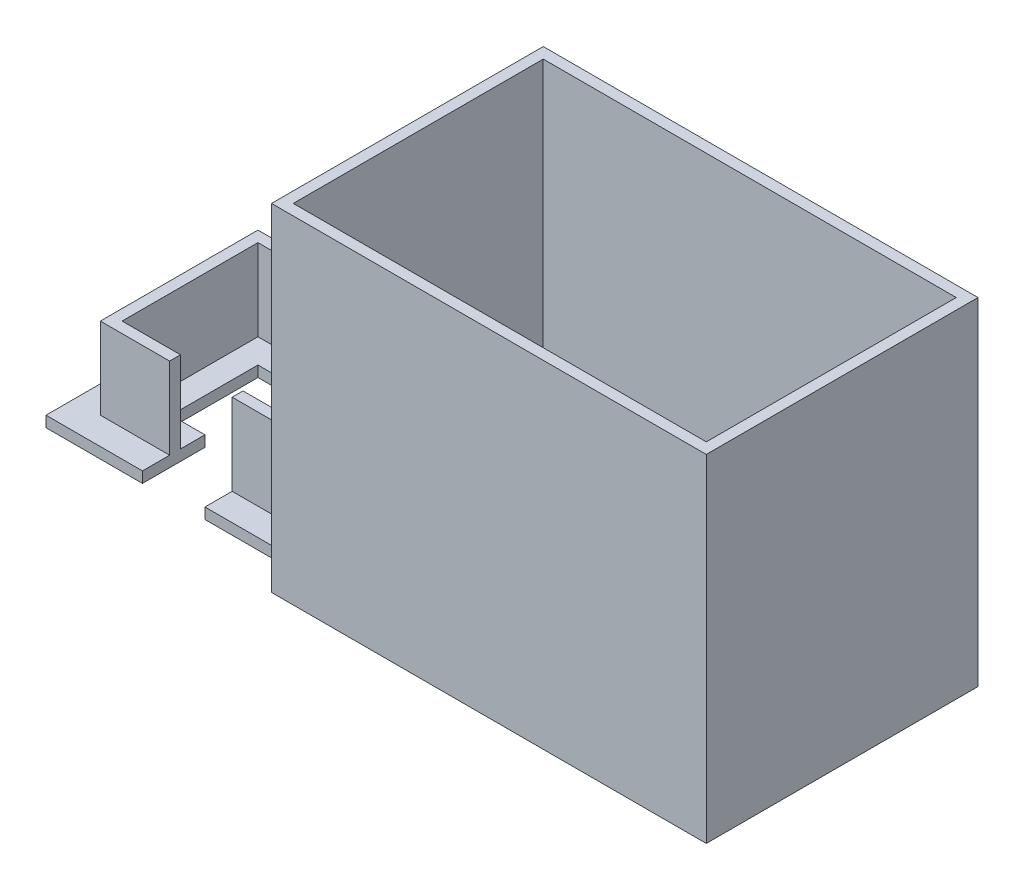
ISO-10303-21;
HEADER;
FILE_DESCRIPTION(('STEP AP214'),'2;1');
FILE_NAME('part.step','',(''),(''),'','','');
FILE_SCHEMA(('AUTOMOTIVE_DESIGN { 1 0 10303 214 1 1 1 1 }'));
ENDSEC;
DATA;
#1=APPLICATION_CONTEXT('core data for automotive mechanical design processes');
#2=APPLICATION_PROTOCOL_DEFINITION('international standard','automotive_design',2000,#1);
#3=PRODUCT_CONTEXT('',#1,'mechanical');
#4=PRODUCT('Part','Part','',(#3));
#5=PRODUCT_RELATED_PRODUCT_CATEGORY('part','',(#4));
#6=PRODUCT_DEFINITION_FORMATION('','',#4);
#7=PRODUCT_DEFINITION_CONTEXT('part definition',#1,'design');
#8=PRODUCT_DEFINITION('design','',#6,#7);
#9=PRODUCT_DEFINITION_SHAPE('','',#8);
#10=(LENGTH_UNIT() NAMED_UNIT(*) SI_UNIT(.MILLI.,.METRE.));
#11=(NAMED_UNIT(*) PLANE_ANGLE_UNIT() SI_UNIT($,.RADIAN.));
#12=(NAMED_UNIT(*) SI_UNIT($,.STERADIAN.) SOLID_ANGLE_UNIT());
#13=UNCERTAINTY_MEASURE_WITH_UNIT(LENGTH_MEASURE(1.E-05),#10,'distance_accuracy_value','');
#14=(GEOMETRIC_REPRESENTATION_CONTEXT(3) GLOBAL_UNCERTAINTY_ASSIGNED_CONTEXT((#13)) GLOBAL_UNIT_ASSIGNED_CONTEXT((#10,
#11,#12)) REPRESENTATION_CONTEXT('',''));
#15=CARTESIAN_POINT('',(0.,0.,0.));
#16=DIRECTION('',(0.,0.,1.));
#17=DIRECTION('',(1.,0.,0.));
#18=AXIS2_PLACEMENT_3D('',#15,#16,#17);
#19=CARTESIAN_POINT('',(0.,2.54,0.));
#20=DIRECTION('',(0.,1.,0.));
#21=DIRECTION('',(0.,0.,1.));
#22=AXIS2_PLACEMENT_3D('',#19,#20,#21);
#23=PLANE('',#22);
#24=DIRECTION('',(0.,0.,-1.));
#25=VECTOR('',#24,1.);
#26=CARTESIAN_POINT('',(-73.3425,2.54,0.));
#27=LINE('',#26,#25);
#28=CARTESIAN_POINT('',(-73.3425,2.54,24.765));
#29=VERTEX_POINT('',#28);
#30=CARTESIAN_POINT('',(-73.3425,2.54,18.415));
#31=VERTEX_POINT('',#30);
#32=EDGE_CURVE('E281',#29,#31,#27,.T.);
#33=ORIENTED_EDGE('',*,*,#32,.F.);
#34=DIRECTION('',(1.,0.,0.));
#35=VECTOR('',#34,1.);
#36=CARTESIAN_POINT('',(0.,2.54,24.765));
#37=LINE('',#36,#35);
#38=CARTESIAN_POINT('',(-50.8,2.54,24.765));
#39=VERTEX_POINT('',#38);
#40=EDGE_CURVE('E361',#29,#39,#37,.T.);
#41=ORIENTED_EDGE('',*,*,#40,.T.);
#42=DIRECTION('',(0.,0.,-1.));
#43=VECTOR('',#42,1.);
#44=CARTESIAN_POINT('',(-50.8,2.54,0.));
#45=LINE('',#44,#43);
#46=CARTESIAN_POINT('',(-50.8,2.54,18.415));
#47=VERTEX_POINT('',#46);
#48=EDGE_CURVE('E362',#39,#47,#45,.T.);
#49=ORIENTED_EDGE('',*,*,#48,.T.);
#50=DIRECTION('',(-1.,0.,0.));
#51=VECTOR('',#50,1.);
#52=CARTESIAN_POINT('',(0.,2.54,18.415));
#53=LINE('',#52,#51);
#54=EDGE_CURVE('E331',#47,#31,#53,.T.);
#55=ORIENTED_EDGE('',*,*,#54,.T.);
#56=EDGE_LOOP('',(#33,#41,#49,#55));
#57=FACE_BOUND('',#56,.T.);
#58=ADVANCED_FACE('F37',(#57),#23,.T.);
#59=CARTESIAN_POINT('',(0.,2.54,24.765));
#60=DIRECTION('',(0.,0.,-1.));
#61=DIRECTION('',(-1.,0.,0.));
#62=AXIS2_PLACEMENT_3D('',#59,#60,#61);
#63=PLANE('',#62);
#64=ORIENTED_EDGE('',*,*,#40,.F.);
#65=DIRECTION('',(0.,1.,0.));
#66=VECTOR('',#65,1.);
#67=CARTESIAN_POINT('',(-73.3425,0.,24.765));
#68=LINE('',#67,#66);
#69=CARTESIAN_POINT('',(-73.3425,0.,24.765));
#70=VERTEX_POINT('',#69);
#71=EDGE_CURVE('E474',#70,#29,#68,.T.);
#72=ORIENTED_EDGE('',*,*,#71,.F.);
#73=DIRECTION('',(1.,0.,0.));
#74=VECTOR('',#73,1.);
#75=CARTESIAN_POINT('',(0.,0.,24.765));
#76=LINE('',#75,#74);
#77=CARTESIAN_POINT('',(-50.8,0.,24.765));
#78=VERTEX_POINT('',#77);
#79=EDGE_CURVE('E260',#70,#78,#76,.T.);
#80=ORIENTED_EDGE('',*,*,#79,.T.);
#81=DIRECTION('',(0.,-1.,0.));
#82=VECTOR('',#81,1.);
#83=CARTESIAN_POINT('',(-50.8,2.54,24.765));
#84=LINE('',#83,#82);
#85=EDGE_CURVE('E388',#39,#78,#84,.T.);
#86=ORIENTED_EDGE('',*,*,#85,.F.);
#87=EDGE_LOOP('',(#64,#72,#80,#86));
#88=FACE_BOUND('',#87,.T.);
#89=ADVANCED_FACE('F473',(#88),#63,.F.);
#90=DIRECTION('',(0.,0.,-1.));
#91=VECTOR('',#90,1.);
#92=CARTESIAN_POINT('',(-73.3425,2.54,0.));
#93=LINE('',#92,#91);
#94=CARTESIAN_POINT('',(-73.3425,2.54,15.875));
#95=VERTEX_POINT('',#94);
#96=CARTESIAN_POINT('',(-73.3425,2.54,10.16));
#97=VERTEX_POINT('',#96);
#98=EDGE_CURVE('E60',#95,#97,#93,.T.);
#99=ORIENTED_EDGE('',*,*,#98,.F.);
#100=DIRECTION('',(-1.,0.,0.));
#101=VECTOR('',#100,1.);
#102=CARTESIAN_POINT('',(0.,2.54,15.875));
#103=LINE('',#102,#101);
#104=CARTESIAN_POINT('',(-50.8,2.54,15.875));
#105=VERTEX_POINT('',#104);
#106=EDGE_CURVE('E300',#105,#95,#103,.T.);
#107=ORIENTED_EDGE('',*,*,#106,.F.);
#108=CARTESIAN_POINT('',(-50.8,2.54,10.16));
#109=VERTEX_POINT('',#108);
#110=EDGE_CURVE('E366',#105,#109,#45,.T.);
#111=ORIENTED_EDGE('',*,*,#110,.T.);
#112=DIRECTION('',(1.,0.,0.));
#113=VECTOR('',#112,1.);
#114=CARTESIAN_POINT('',(-50.8,2.54,10.16));
#115=LINE('',#114,#113);
#116=EDGE_CURVE('E284',#97,#109,#115,.T.);
#117=ORIENTED_EDGE('',*,*,#116,.F.);
#118=EDGE_LOOP('',(#99,#107,#111,#117));
#119=FACE_BOUND('',#118,.T.);
#120=ADVANCED_FACE('F534',(#119),#23,.T.);
#121=CARTESIAN_POINT('',(0.,21.59,18.415));
#122=DIRECTION('',(0.,0.,1.));
#123=DIRECTION('',(1.,0.,0.));
#124=AXIS2_PLACEMENT_3D('',#121,#122,#123);
#125=PLANE('',#124);
#126=DIRECTION('',(0.,1.,0.));
#127=VECTOR('',#126,1.);
#128=CARTESIAN_POINT('',(-73.3425,21.59,18.415));
#129=LINE('',#128,#127);
#130=CARTESIAN_POINT('',(-73.3425,21.59,18.415));
#131=VERTEX_POINT('',#130);
#132=EDGE_CURVE('E497',#31,#131,#129,.T.);
#133=ORIENTED_EDGE('',*,*,#132,.F.);
#134=ORIENTED_EDGE('',*,*,#54,.F.);
#135=DIRECTION('',(0.,-1.,0.));
#136=VECTOR('',#135,1.);
#137=CARTESIAN_POINT('',(-50.8,21.59,18.415));
#138=LINE('',#137,#136);
#139=CARTESIAN_POINT('',(-50.8,21.59,18.415));
#140=VERTEX_POINT('',#139);
#141=EDGE_CURVE('E341',#140,#47,#138,.T.);
#142=ORIENTED_EDGE('',*,*,#141,.F.);
#143=DIRECTION('',(-1.,0.,0.));
#144=VECTOR('',#143,1.);
#145=CARTESIAN_POINT('',(0.,21.59,18.415));
#146=LINE('',#145,#144);
#147=EDGE_CURVE('E312',#140,#131,#146,.T.);
#148=ORIENTED_EDGE('',*,*,#147,.T.);
#149=EDGE_LOOP('',(#133,#134,#142,#148));
#150=FACE_BOUND('',#149,.T.);
#151=ADVANCED_FACE('F571',(#150),#125,.T.);
#152=CARTESIAN_POINT('',(0.,21.59,15.875));
#153=DIRECTION('',(0.,0.,1.));
#154=DIRECTION('',(1.,0.,0.));
#155=AXIS2_PLACEMENT_3D('',#152,#153,#154);
#156=PLANE('',#155);
#157=ORIENTED_EDGE('',*,*,#106,.T.);
#158=DIRECTION('',(0.,1.,0.));
#159=VECTOR('',#158,1.);
#160=CARTESIAN_POINT('',(-73.3425,21.59,15.875));
#161=LINE('',#160,#159);
#162=CARTESIAN_POINT('',(-73.3425,21.59,15.875));
#163=VERTEX_POINT('',#162);
#164=EDGE_CURVE('E493',#95,#163,#161,.T.);
#165=ORIENTED_EDGE('',*,*,#164,.T.);
#166=DIRECTION('',(-1.,0.,0.));
#167=VECTOR('',#166,1.);
#168=CARTESIAN_POINT('',(0.,21.59,15.875));
#169=LINE('',#168,#167);
#170=CARTESIAN_POINT('',(-50.8,21.59,15.875));
#171=VERTEX_POINT('',#170);
#172=EDGE_CURVE('E315',#171,#163,#169,.T.);
#173=ORIENTED_EDGE('',*,*,#172,.F.);
#174=DIRECTION('',(0.,-1.,0.));
#175=VECTOR('',#174,1.);
#176=CARTESIAN_POINT('',(-50.8,21.59,15.875));
#177=LINE('',#176,#175);
#178=EDGE_CURVE('E339',#171,#105,#177,.T.);
#179=ORIENTED_EDGE('',*,*,#178,.T.);
#180=EDGE_LOOP('',(#157,#165,#173,#179));
#181=FACE_BOUND('',#180,.T.);
#182=ADVANCED_FACE('F567',(#181),#156,.F.);
#183=CARTESIAN_POINT('',(0.,21.59,0.));
#184=DIRECTION('',(0.,1.,0.));
#185=DIRECTION('',(0.,0.,1.));
#186=AXIS2_PLACEMENT_3D('',#183,#184,#185);
#187=PLANE('',#186);
#188=DIRECTION('',(0.,0.,-1.));
#189=VECTOR('',#188,1.);
#190=CARTESIAN_POINT('',(-73.3425,21.59,10.16));
#191=LINE('',#190,#189);
#192=EDGE_CURVE('E560',#131,#163,#191,.T.);
#193=ORIENTED_EDGE('',*,*,#192,.F.);
#194=ORIENTED_EDGE('',*,*,#147,.F.);
#195=DIRECTION('',(0.,0.,-1.));
#196=VECTOR('',#195,1.);
#197=CARTESIAN_POINT('',(-50.8,21.59,0.));
#198=LINE('',#197,#196);
#199=EDGE_CURVE('E306',#140,#171,#198,.T.);
#200=ORIENTED_EDGE('',*,*,#199,.T.);
#201=ORIENTED_EDGE('',*,*,#172,.T.);
#202=EDGE_LOOP('',(#193,#194,#200,#201));
#203=FACE_BOUND('',#202,.T.);
#204=ADVANCED_FACE('F568',(#203),#187,.T.);
#205=CARTESIAN_POINT('',(-50.8,0.,10.16));
#206=DIRECTION('',(0.,0.,1.));
#207=DIRECTION('',(1.,0.,0.));
#208=AXIS2_PLACEMENT_3D('',#205,#206,#207);
#209=PLANE('',#208);
#210=DIRECTION('',(1.,0.,0.));
#211=VECTOR('',#210,1.);
#212=CARTESIAN_POINT('',(-50.8,0.,10.16));
#213=LINE('',#212,#211);
#214=CARTESIAN_POINT('',(-73.3425,0.,10.16));
#215=VERTEX_POINT('',#214);
#216=CARTESIAN_POINT('',(-50.8,0.,10.16));
#217=VERTEX_POINT('',#216);
#218=EDGE_CURVE('E257',#215,#217,#213,.T.);
#219=ORIENTED_EDGE('',*,*,#218,.F.);
#220=DIRECTION('',(0.,1.,0.));
#221=VECTOR('',#220,1.);
#222=CARTESIAN_POINT('',(-73.3425,0.,10.16));
#223=LINE('',#222,#221);
#224=EDGE_CURVE('E243',#215,#97,#223,.T.);
#225=ORIENTED_EDGE('',*,*,#224,.T.);
#226=ORIENTED_EDGE('',*,*,#116,.T.);
#227=DIRECTION('',(0.,1.,0.));
#228=VECTOR('',#227,1.);
#229=CARTESIAN_POINT('',(-50.8,0.,10.16));
#230=LINE('',#229,#228);
#231=EDGE_CURVE('E265',#217,#109,#230,.T.);
#232=ORIENTED_EDGE('',*,*,#231,.F.);
#233=EDGE_LOOP('',(#219,#225,#226,#232));
#234=FACE_BOUND('',#233,.T.);
#235=ADVANCED_FACE('F263',(#234),#209,.F.);
#236=DIRECTION('',(0.,0.,1.));
#237=VECTOR('',#236,1.);
#238=CARTESIAN_POINT('',(-87.9475,2.54,0.));
#239=LINE('',#238,#237);
#240=CARTESIAN_POINT('',(-87.9475,2.54,18.415));
#241=VERTEX_POINT('',#240);
#242=CARTESIAN_POINT('',(-87.9475,2.54,24.765));
#243=VERTEX_POINT('',#242);
#244=EDGE_CURVE('E491',#241,#243,#239,.T.);
#245=ORIENTED_EDGE('',*,*,#244,.F.);
#246=CARTESIAN_POINT('',(-104.14,2.54,18.415));
#247=VERTEX_POINT('',#246);
#248=EDGE_CURVE('E330',#241,#247,#53,.T.);
#249=ORIENTED_EDGE('',*,*,#248,.T.);
#250=DIRECTION('',(0.,0.,1.));
#251=VECTOR('',#250,1.);
#252=CARTESIAN_POINT('',(-104.14,2.54,0.));
#253=LINE('',#252,#251);
#254=CARTESIAN_POINT('',(-104.14,2.54,-18.415));
#255=VERTEX_POINT('',#254);
#256=EDGE_CURVE('E327',#255,#247,#253,.T.);
#257=ORIENTED_EDGE('',*,*,#256,.F.);
#258=DIRECTION('',(-1.,0.,0.));
#259=VECTOR('',#258,1.);
#260=CARTESIAN_POINT('',(0.,2.54,-18.415));
#261=LINE('',#260,#259);
#262=CARTESIAN_POINT('',(-50.8,2.54,-18.415));
#263=VERTEX_POINT('',#262);
#264=EDGE_CURVE('E325',#263,#255,#261,.T.);
#265=ORIENTED_EDGE('',*,*,#264,.F.);
#266=CARTESIAN_POINT('',(-50.8,2.54,-24.765));
#267=VERTEX_POINT('',#266);
#268=EDGE_CURVE('E360',#263,#267,#45,.T.);
#269=ORIENTED_EDGE('',*,*,#268,.T.);
#270=DIRECTION('',(1.,0.,0.));
#271=VECTOR('',#270,1.);
#272=CARTESIAN_POINT('',(0.,2.54,-24.765));
#273=LINE('',#272,#271);
#274=CARTESIAN_POINT('',(-110.49,2.54,-24.765));
#275=VERTEX_POINT('',#274);
#276=EDGE_CURVE('E365',#275,#267,#273,.T.);
#277=ORIENTED_EDGE('',*,*,#276,.F.);
#278=DIRECTION('',(0.,0.,-1.));
#279=VECTOR('',#278,1.);
#280=CARTESIAN_POINT('',(-110.49,2.54,0.));
#281=LINE('',#280,#279);
#282=CARTESIAN_POINT('',(-110.49,2.54,24.765));
#283=VERTEX_POINT('',#282);
#284=EDGE_CURVE('E370',#283,#275,#281,.T.);
#285=ORIENTED_EDGE('',*,*,#284,.F.);
#286=EDGE_CURVE('E357',#283,#243,#37,.T.);
#287=ORIENTED_EDGE('',*,*,#286,.T.);
#288=EDGE_LOOP('',(#245,#249,#257,#265,#269,#277,#285,#287));
#289=FACE_BOUND('',#288,.T.);
#290=ADVANCED_FACE('F581',(#289),#23,.T.);
#291=CARTESIAN_POINT('',(0.,78.74,31.75));
#292=DIRECTION('',(0.,0.,-1.));
#293=DIRECTION('',(-1.,0.,0.));
#294=AXIS2_PLACEMENT_3D('',#291,#292,#293);
#295=PLANE('',#294);
#296=DIRECTION('',(1.,0.,0.));
#297=VECTOR('',#296,1.);
#298=CARTESIAN_POINT('',(0.,0.,31.75));
#299=LINE('',#298,#297);
#300=CARTESIAN_POINT('',(-50.8,0.,31.75));
#301=VERTEX_POINT('',#300);
#302=CARTESIAN_POINT('',(50.8,0.,31.75));
#303=VERTEX_POINT('',#302);
#304=EDGE_CURVE('E398',#301,#303,#299,.T.);
#305=ORIENTED_EDGE('',*,*,#304,.T.);
#306=DIRECTION('',(0.,-1.,0.));
#307=VECTOR('',#306,1.);
#308=CARTESIAN_POINT('',(50.8,78.74,31.75));
#309=LINE('',#308,#307);
#310=CARTESIAN_POINT('',(50.8,78.74,31.75));
#311=VERTEX_POINT('',#310);
#312=EDGE_CURVE('E11',#311,#303,#309,.T.);
#313=ORIENTED_EDGE('',*,*,#312,.F.);
#314=DIRECTION('',(1.,0.,0.));
#315=VECTOR('',#314,1.);
#316=CARTESIAN_POINT('',(0.,78.74,31.75));
#317=LINE('',#316,#315);
#318=CARTESIAN_POINT('',(-50.8,78.74,31.75));
#319=VERTEX_POINT('',#318);
#320=EDGE_CURVE('E423',#319,#311,#317,.T.);
#321=ORIENTED_EDGE('',*,*,#320,.F.);
#322=DIRECTION('',(0.,-1.,0.));
#323=VECTOR('',#322,1.);
#324=CARTESIAN_POINT('',(-50.8,78.74,31.75));
#325=LINE('',#324,#323);
#326=EDGE_CURVE('E435',#319,#301,#325,.T.);
#327=ORIENTED_EDGE('',*,*,#326,.T.);
#328=EDGE_LOOP('',(#305,#313,#321,#327));
#329=FACE_BOUND('',#328,.T.);
#330=ADVANCED_FACE('F39',(#329),#295,.F.);
#331=CARTESIAN_POINT('',(50.8,78.74,0.));
#332=DIRECTION('',(-1.,0.,0.));
#333=DIRECTION('',(0.,0.,1.));
#334=AXIS2_PLACEMENT_3D('',#331,#332,#333);
#335=PLANE('',#334);
#336=DIRECTION('',(0.,0.,-1.));
#337=VECTOR('',#336,1.);
#338=CARTESIAN_POINT('',(50.8,0.,0.));
#339=LINE('',#338,#337);
#340=CARTESIAN_POINT('',(50.8,0.,-31.75));
#341=VERTEX_POINT('',#340);
#342=EDGE_CURVE('E438',#303,#341,#339,.T.);
#343=ORIENTED_EDGE('',*,*,#342,.T.);
#344=DIRECTION('',(0.,-1.,0.));
#345=VECTOR('',#344,1.);
#346=CARTESIAN_POINT('',(50.8,78.74,-31.75));
#347=LINE('',#346,#345);
#348=CARTESIAN_POINT('',(50.8,78.74,-31.75));
#349=VERTEX_POINT('',#348);
#350=EDGE_CURVE('E45',#349,#341,#347,.T.);
#351=ORIENTED_EDGE('',*,*,#350,.F.);
#352=DIRECTION('',(0.,0.,-1.));
#353=VECTOR('',#352,1.);
#354=CARTESIAN_POINT('',(50.8,78.74,0.));
#355=LINE('',#354,#353);
#356=EDGE_CURVE('E426',#311,#349,#355,.T.);
#357=ORIENTED_EDGE('',*,*,#356,.F.);
#358=ORIENTED_EDGE('',*,*,#312,.T.);
#359=EDGE_LOOP('',(#343,#351,#357,#358));
#360=FACE_BOUND('',#359,.T.);
#361=ADVANCED_FACE('F455',(#360),#335,.F.);
#362=CARTESIAN_POINT('',(0.,78.74,-31.75));
#363=DIRECTION('',(0.,0.,-1.));
#364=DIRECTION('',(-1.,0.,0.));
#365=AXIS2_PLACEMENT_3D('',#362,#363,#364);
#366=PLANE('',#365);
#367=DIRECTION('',(1.,0.,0.));
#368=VECTOR('',#367,1.);
#369=CARTESIAN_POINT('',(0.,0.,-31.75));
#370=LINE('',#369,#368);
#371=CARTESIAN_POINT('',(-50.8,0.,-31.75));
#372=VERTEX_POINT('',#371);
#373=EDGE_CURVE('E441',#372,#341,#370,.T.);
#374=ORIENTED_EDGE('',*,*,#373,.F.);
#375=DIRECTION('',(0.,-1.,0.));
#376=VECTOR('',#375,1.);
#377=CARTESIAN_POINT('',(-50.8,78.74,-31.75));
#378=LINE('',#377,#376);
#379=CARTESIAN_POINT('',(-50.8,78.74,-31.75));
#380=VERTEX_POINT('',#379);
#381=EDGE_CURVE('E447',#380,#372,#378,.T.);
#382=ORIENTED_EDGE('',*,*,#381,.F.);
#383=DIRECTION('',(1.,0.,0.));
#384=VECTOR('',#383,1.);
#385=CARTESIAN_POINT('',(0.,78.74,-31.75));
#386=LINE('',#385,#384);
#387=EDGE_CURVE('E429',#380,#349,#386,.T.);
#388=ORIENTED_EDGE('',*,*,#387,.T.);
#389=ORIENTED_EDGE('',*,*,#350,.T.);
#390=EDGE_LOOP('',(#374,#382,#388,#389));
#391=FACE_BOUND('',#390,.T.);
#392=ADVANCED_FACE('F452',(#391),#366,.T.);
#393=CARTESIAN_POINT('',(-50.8,78.74,0.));
#394=DIRECTION('',(-1.,0.,0.));
#395=DIRECTION('',(0.,0.,1.));
#396=AXIS2_PLACEMENT_3D('',#393,#394,#395);
#397=PLANE('',#396);
#398=ORIENTED_EDGE('',*,*,#141,.T.);
#399=ORIENTED_EDGE('',*,*,#48,.F.);
#400=ORIENTED_EDGE('',*,*,#85,.T.);
#401=DIRECTION('',(0.,0.,-1.));
#402=VECTOR('',#401,1.);
#403=CARTESIAN_POINT('',(-50.8,0.,0.));
#404=LINE('',#403,#402);
#405=EDGE_CURVE('E427',#301,#78,#404,.T.);
#406=ORIENTED_EDGE('',*,*,#405,.F.);
#407=ORIENTED_EDGE('',*,*,#326,.F.);
#408=DIRECTION('',(0.,0.,-1.));
#409=VECTOR('',#408,1.);
#410=CARTESIAN_POINT('',(-50.8,78.74,0.));
#411=LINE('',#410,#409);
#412=EDGE_CURVE('E432',#319,#380,#411,.T.);
#413=ORIENTED_EDGE('',*,*,#412,.T.);
#414=ORIENTED_EDGE('',*,*,#381,.T.);
#415=CARTESIAN_POINT('',(-50.8,0.,-24.765));
#416=VERTEX_POINT('',#415);
#417=EDGE_CURVE('E444',#416,#372,#404,.T.);
#418=ORIENTED_EDGE('',*,*,#417,.F.);
#419=DIRECTION('',(0.,-1.,0.));
#420=VECTOR('',#419,1.);
#421=CARTESIAN_POINT('',(-50.8,2.54,-24.765));
#422=LINE('',#421,#420);
#423=EDGE_CURVE('E386',#267,#416,#422,.T.);
#424=ORIENTED_EDGE('',*,*,#423,.F.);
#425=ORIENTED_EDGE('',*,*,#268,.F.);
#426=DIRECTION('',(0.,-1.,0.));
#427=VECTOR('',#426,1.);
#428=CARTESIAN_POINT('',(-50.8,21.59,-18.415));
#429=LINE('',#428,#427);
#430=CARTESIAN_POINT('',(-50.8,21.59,-18.415));
#431=VERTEX_POINT('',#430);
#432=EDGE_CURVE('E350',#431,#263,#429,.T.);
#433=ORIENTED_EDGE('',*,*,#432,.F.);
#434=CARTESIAN_POINT('',(-50.8,21.59,-15.875));
#435=VERTEX_POINT('',#434);
#436=EDGE_CURVE('E303',#435,#431,#198,.T.);
#437=ORIENTED_EDGE('',*,*,#436,.F.);
#438=DIRECTION('',(0.,-1.,0.));
#439=VECTOR('',#438,1.);
#440=CARTESIAN_POINT('',(-50.8,21.59,-15.875));
#441=LINE('',#440,#439);
#442=CARTESIAN_POINT('',(-50.8,2.54,-15.875));
#443=VERTEX_POINT('',#442);
#444=EDGE_CURVE('E352',#435,#443,#441,.T.);
#445=ORIENTED_EDGE('',*,*,#444,.T.);
#446=CARTESIAN_POINT('',(-50.8,2.54,-10.16));
#447=VERTEX_POINT('',#446);
#448=EDGE_CURVE('E367',#447,#443,#45,.T.);
#449=ORIENTED_EDGE('',*,*,#448,.F.);
#450=DIRECTION('',(0.,1.,0.));
#451=VECTOR('',#450,1.);
#452=CARTESIAN_POINT('',(-50.8,0.,-10.16));
#453=LINE('',#452,#451);
#454=CARTESIAN_POINT('',(-50.8,0.,-10.16));
#455=VERTEX_POINT('',#454);
#456=EDGE_CURVE('E271',#455,#447,#453,.T.);
#457=ORIENTED_EDGE('',*,*,#456,.F.);
#458=DIRECTION('',(0.,0.,-1.));
#459=VECTOR('',#458,1.);
#460=CARTESIAN_POINT('',(-50.8,0.,-10.16));
#461=LINE('',#460,#459);
#462=EDGE_CURVE('E288',#217,#455,#461,.T.);
#463=ORIENTED_EDGE('',*,*,#462,.F.);
#464=ORIENTED_EDGE('',*,*,#231,.T.);
#465=ORIENTED_EDGE('',*,*,#110,.F.);
#466=ORIENTED_EDGE('',*,*,#178,.F.);
#467=ORIENTED_EDGE('',*,*,#199,.F.);
#468=EDGE_LOOP('',(#398,#399,#400,#406,#407,#413,#414,#418,#424,#425,#433,#437,#445,#449,#457,
#463,#464,#465,#466,#467));
#469=FACE_BOUND('',#468,.T.);
#470=ADVANCED_FACE('F462',(#469),#397,.T.);
#471=CARTESIAN_POINT('',(0.,78.74,0.));
#472=DIRECTION('',(0.,1.,0.));
#473=DIRECTION('',(0.,0.,1.));
#474=AXIS2_PLACEMENT_3D('',#471,#472,#473);
#475=PLANE('',#474);
#476=DIRECTION('',(1.,0.,0.));
#477=VECTOR('',#476,1.);
#478=CARTESIAN_POINT('',(0.,78.74,29.21));
#479=LINE('',#478,#477);
#480=CARTESIAN_POINT('',(-48.26,78.74,29.21));
#481=VERTEX_POINT('',#480);
#482=CARTESIAN_POINT('',(48.26,78.74,29.21));
#483=VERTEX_POINT('',#482);
#484=EDGE_CURVE('E414',#481,#483,#479,.T.);
#485=ORIENTED_EDGE('',*,*,#484,.F.);
#486=DIRECTION('',(0.,0.,-1.));
#487=VECTOR('',#486,1.);
#488=CARTESIAN_POINT('',(-48.26,78.74,0.));
#489=LINE('',#488,#487);
#490=CARTESIAN_POINT('',(-48.26,78.74,-29.21));
#491=VERTEX_POINT('',#490);
#492=EDGE_CURVE('E403',#481,#491,#489,.T.);
#493=ORIENTED_EDGE('',*,*,#492,.T.);
#494=DIRECTION('',(1.,0.,0.));
#495=VECTOR('',#494,1.);
#496=CARTESIAN_POINT('',(0.,78.74,-29.21));
#497=LINE('',#496,#495);
#498=CARTESIAN_POINT('',(48.26,78.74,-29.21));
#499=VERTEX_POINT('',#498);
#500=EDGE_CURVE('E418',#491,#499,#497,.T.);
#501=ORIENTED_EDGE('',*,*,#500,.T.);
#502=DIRECTION('',(0.,0.,-1.));
#503=VECTOR('',#502,1.);
#504=CARTESIAN_POINT('',(48.26,78.74,0.));
#505=LINE('',#504,#503);
#506=EDGE_CURVE('E416',#483,#499,#505,.T.);
#507=ORIENTED_EDGE('',*,*,#506,.F.);
#508=EDGE_LOOP('',(#485,#493,#501,#507));
#509=FACE_BOUND('',#508,.T.);
#510=ORIENTED_EDGE('',*,*,#320,.T.);
#511=ORIENTED_EDGE('',*,*,#356,.T.);
#512=ORIENTED_EDGE('',*,*,#387,.F.);
#513=ORIENTED_EDGE('',*,*,#412,.F.);
#514=EDGE_LOOP('',(#510,#511,#512,#513));
#515=FACE_BOUND('',#514,.T.);
#516=ADVANCED_FACE('F465',(#509,#515),#475,.T.);
#517=CARTESIAN_POINT('',(0.,0.,0.));
#518=DIRECTION('',(0.,1.,0.));
#519=DIRECTION('',(0.,0.,1.));
#520=AXIS2_PLACEMENT_3D('',#517,#518,#519);
#521=PLANE('',#520);
#522=ORIENTED_EDGE('',*,*,#79,.F.);
#523=DIRECTION('',(0.,0.,-1.));
#524=VECTOR('',#523,1.);
#525=CARTESIAN_POINT('',(-73.3425,0.,10.16));
#526=LINE('',#525,#524);
#527=EDGE_CURVE('E246',#70,#215,#526,.T.);
#528=ORIENTED_EDGE('',*,*,#527,.T.);
#529=ORIENTED_EDGE('',*,*,#218,.T.);
#530=ORIENTED_EDGE('',*,*,#462,.T.);
#531=DIRECTION('',(-1.,0.,0.));
#532=VECTOR('',#531,1.);
#533=CARTESIAN_POINT('',(-50.8,0.,-10.16));
#534=LINE('',#533,#532);
#535=CARTESIAN_POINT('',(-95.885,0.,-10.16));
#536=VERTEX_POINT('',#535);
#537=EDGE_CURVE('E273',#455,#536,#534,.T.);
#538=ORIENTED_EDGE('',*,*,#537,.T.);
#539=DIRECTION('',(0.,0.,1.));
#540=VECTOR('',#539,1.);
#541=CARTESIAN_POINT('',(-95.885,0.,-10.16));
#542=LINE('',#541,#540);
#543=CARTESIAN_POINT('',(-95.885,0.,10.16));
#544=VERTEX_POINT('',#543);
#545=EDGE_CURVE('E268',#536,#544,#542,.T.);
#546=ORIENTED_EDGE('',*,*,#545,.T.);
#547=CARTESIAN_POINT('',(-87.9475,0.,10.16));
#548=VERTEX_POINT('',#547);
#549=EDGE_CURVE('E267',#544,#548,#213,.T.);
#550=ORIENTED_EDGE('',*,*,#549,.T.);
#551=DIRECTION('',(0.,0.,1.));
#552=VECTOR('',#551,1.);
#553=CARTESIAN_POINT('',(-87.9475,0.,10.16));
#554=LINE('',#553,#552);
#555=CARTESIAN_POINT('',(-87.9475,0.,24.765));
#556=VERTEX_POINT('',#555);
#557=EDGE_CURVE('E52',#548,#556,#554,.T.);
#558=ORIENTED_EDGE('',*,*,#557,.T.);
#559=CARTESIAN_POINT('',(-110.49,0.,24.765));
#560=VERTEX_POINT('',#559);
#561=EDGE_CURVE('E374',#560,#556,#76,.T.);
#562=ORIENTED_EDGE('',*,*,#561,.F.);
#563=DIRECTION('',(0.,0.,-1.));
#564=VECTOR('',#563,1.);
#565=CARTESIAN_POINT('',(-110.49,0.,0.));
#566=LINE('',#565,#564);
#567=CARTESIAN_POINT('',(-110.49,0.,-24.765));
#568=VERTEX_POINT('',#567);
#569=EDGE_CURVE('E380',#560,#568,#566,.T.);
#570=ORIENTED_EDGE('',*,*,#569,.T.);
#571=DIRECTION('',(1.,0.,0.));
#572=VECTOR('',#571,1.);
#573=CARTESIAN_POINT('',(0.,0.,-24.765));
#574=LINE('',#573,#572);
#575=EDGE_CURVE('E377',#568,#416,#574,.T.);
#576=ORIENTED_EDGE('',*,*,#575,.T.);
#577=ORIENTED_EDGE('',*,*,#417,.T.);
#578=ORIENTED_EDGE('',*,*,#373,.T.);
#579=ORIENTED_EDGE('',*,*,#342,.F.);
#580=ORIENTED_EDGE('',*,*,#304,.F.);
#581=ORIENTED_EDGE('',*,*,#405,.T.);
#582=EDGE_LOOP('',(#522,#528,#529,#530,#538,#546,#550,#558,#562,#570,#576,#577,#578,#579,#580,#581));
#583=FACE_BOUND('',#582,.T.);
#584=ADVANCED_FACE('F255',(#583),#521,.F.);
#585=CARTESIAN_POINT('',(0.,78.74,29.21));
#586=DIRECTION('',(0.,0.,-1.));
#587=DIRECTION('',(-1.,0.,0.));
#588=AXIS2_PLACEMENT_3D('',#585,#586,#587);
#589=PLANE('',#588);
#590=DIRECTION('',(1.,0.,0.));
#591=VECTOR('',#590,1.);
#592=CARTESIAN_POINT('',(0.,2.54,29.21));
#593=LINE('',#592,#591);
#594=CARTESIAN_POINT('',(-48.26,2.54,29.21));
#595=VERTEX_POINT('',#594);
#596=CARTESIAN_POINT('',(48.26,2.54,29.21));
#597=VERTEX_POINT('',#596);
#598=EDGE_CURVE('E391',#595,#597,#593,.T.);
#599=ORIENTED_EDGE('',*,*,#598,.F.);
#600=DIRECTION('',(0.,-1.,0.));
#601=VECTOR('',#600,1.);
#602=CARTESIAN_POINT('',(-48.26,78.74,29.21));
#603=LINE('',#602,#601);
#604=EDGE_CURVE('E400',#481,#595,#603,.T.);
#605=ORIENTED_EDGE('',*,*,#604,.F.);
#606=ORIENTED_EDGE('',*,*,#484,.T.);
#607=DIRECTION('',(0.,-1.,0.));
#608=VECTOR('',#607,1.);
#609=CARTESIAN_POINT('',(48.26,78.74,29.21));
#610=LINE('',#609,#608);
#611=EDGE_CURVE('E395',#483,#597,#610,.T.);
#612=ORIENTED_EDGE('',*,*,#611,.T.);
#613=EDGE_LOOP('',(#599,#605,#606,#612));
#614=FACE_BOUND('',#613,.T.);
#615=ADVANCED_FACE('F687',(#614),#589,.T.);
#616=CARTESIAN_POINT('',(48.26,78.74,0.));
#617=DIRECTION('',(-1.,0.,0.));
#618=DIRECTION('',(0.,0.,1.));
#619=AXIS2_PLACEMENT_3D('',#616,#617,#618);
#620=PLANE('',#619);
#621=DIRECTION('',(0.,0.,-1.));
#622=VECTOR('',#621,1.);
#623=CARTESIAN_POINT('',(48.26,2.54,0.));
#624=LINE('',#623,#622);
#625=CARTESIAN_POINT('',(48.26,2.54,-29.21));
#626=VERTEX_POINT('',#625);
#627=EDGE_CURVE('E394',#597,#626,#624,.T.);
#628=ORIENTED_EDGE('',*,*,#627,.F.);
#629=ORIENTED_EDGE('',*,*,#611,.F.);
#630=ORIENTED_EDGE('',*,*,#506,.T.);
#631=DIRECTION('',(0.,-1.,0.));
#632=VECTOR('',#631,1.);
#633=CARTESIAN_POINT('',(48.26,78.74,-29.21));
#634=LINE('',#633,#632);
#635=EDGE_CURVE('E399',#499,#626,#634,.T.);
#636=ORIENTED_EDGE('',*,*,#635,.T.);
#637=EDGE_LOOP('',(#628,#629,#630,#636));
#638=FACE_BOUND('',#637,.T.);
#639=ADVANCED_FACE('F677',(#638),#620,.T.);
#640=CARTESIAN_POINT('',(0.,78.74,-29.21));
#641=DIRECTION('',(0.,0.,-1.));
#642=DIRECTION('',(-1.,0.,0.));
#643=AXIS2_PLACEMENT_3D('',#640,#641,#642);
#644=PLANE('',#643);
#645=DIRECTION('',(1.,0.,0.));
#646=VECTOR('',#645,1.);
#647=CARTESIAN_POINT('',(0.,2.54,-29.21));
#648=LINE('',#647,#646);
#649=CARTESIAN_POINT('',(-48.26,2.54,-29.21));
#650=VERTEX_POINT('',#649);
#651=EDGE_CURVE('E406',#650,#626,#648,.T.);
#652=ORIENTED_EDGE('',*,*,#651,.T.);
#653=ORIENTED_EDGE('',*,*,#635,.F.);
#654=ORIENTED_EDGE('',*,*,#500,.F.);
#655=DIRECTION('',(0.,-1.,0.));
#656=VECTOR('',#655,1.);
#657=CARTESIAN_POINT('',(-48.26,78.74,-29.21));
#658=LINE('',#657,#656);
#659=EDGE_CURVE('E402',#491,#650,#658,.T.);
#660=ORIENTED_EDGE('',*,*,#659,.T.);
#661=EDGE_LOOP('',(#652,#653,#654,#660));
#662=FACE_BOUND('',#661,.T.);
#663=ADVANCED_FACE('F666',(#662),#644,.F.);
#664=CARTESIAN_POINT('',(-48.26,78.74,0.));
#665=DIRECTION('',(-1.,0.,0.));
#666=DIRECTION('',(0.,0.,1.));
#667=AXIS2_PLACEMENT_3D('',#664,#665,#666);
#668=PLANE('',#667);
#669=DIRECTION('',(0.,0.,-1.));
#670=VECTOR('',#669,1.);
#671=CARTESIAN_POINT('',(-48.26,2.54,0.));
#672=LINE('',#671,#670);
#673=EDGE_CURVE('E410',#595,#650,#672,.T.);
#674=ORIENTED_EDGE('',*,*,#673,.T.);
#675=ORIENTED_EDGE('',*,*,#659,.F.);
#676=ORIENTED_EDGE('',*,*,#492,.F.);
#677=ORIENTED_EDGE('',*,*,#604,.T.);
#678=EDGE_LOOP('',(#674,#675,#676,#677));
#679=FACE_BOUND('',#678,.T.);
#680=ADVANCED_FACE('F655',(#679),#668,.F.);
#681=CARTESIAN_POINT('',(0.,2.54,0.));
#682=DIRECTION('',(0.,1.,0.));
#683=DIRECTION('',(0.,0.,1.));
#684=AXIS2_PLACEMENT_3D('',#681,#682,#683);
#685=PLANE('',#684);
#686=ORIENTED_EDGE('',*,*,#598,.T.);
#687=ORIENTED_EDGE('',*,*,#627,.T.);
#688=ORIENTED_EDGE('',*,*,#651,.F.);
#689=ORIENTED_EDGE('',*,*,#673,.F.);
#690=EDGE_LOOP('',(#686,#687,#688,#689));
#691=FACE_BOUND('',#690,.T.);
#692=ADVANCED_FACE('F650',(#691),#685,.T.);
#693=ORIENTED_EDGE('',*,*,#561,.T.);
#694=DIRECTION('',(0.,1.,0.));
#695=VECTOR('',#694,1.);
#696=CARTESIAN_POINT('',(-87.9475,0.,24.765));
#697=LINE('',#696,#695);
#698=EDGE_CURVE('E477',#556,#243,#697,.T.);
#699=ORIENTED_EDGE('',*,*,#698,.T.);
#700=ORIENTED_EDGE('',*,*,#286,.F.);
#701=DIRECTION('',(0.,-1.,0.));
#702=VECTOR('',#701,1.);
#703=CARTESIAN_POINT('',(-110.49,2.54,24.765));
#704=LINE('',#703,#702);
#705=EDGE_CURVE('E373',#283,#560,#704,.T.);
#706=ORIENTED_EDGE('',*,*,#705,.T.);
#707=EDGE_LOOP('',(#693,#699,#700,#706));
#708=FACE_BOUND('',#707,.T.);
#709=ADVANCED_FACE('F517',(#708),#63,.F.);
#710=CARTESIAN_POINT('',(0.,2.54,-24.765));
#711=DIRECTION('',(0.,0.,-1.));
#712=DIRECTION('',(-1.,0.,0.));
#713=AXIS2_PLACEMENT_3D('',#710,#711,#712);
#714=PLANE('',#713);
#715=ORIENTED_EDGE('',*,*,#575,.F.);
#716=DIRECTION('',(0.,-1.,0.));
#717=VECTOR('',#716,1.);
#718=CARTESIAN_POINT('',(-110.49,2.54,-24.765));
#719=LINE('',#718,#717);
#720=EDGE_CURVE('E384',#275,#568,#719,.T.);
#721=ORIENTED_EDGE('',*,*,#720,.F.);
#722=ORIENTED_EDGE('',*,*,#276,.T.);
#723=ORIENTED_EDGE('',*,*,#423,.T.);
#724=EDGE_LOOP('',(#715,#721,#722,#723));
#725=FACE_BOUND('',#724,.T.);
#726=ADVANCED_FACE('F524',(#725),#714,.T.);
#727=CARTESIAN_POINT('',(-110.49,2.54,0.));
#728=DIRECTION('',(-1.,0.,0.));
#729=DIRECTION('',(0.,0.,1.));
#730=AXIS2_PLACEMENT_3D('',#727,#728,#729);
#731=PLANE('',#730);
#732=ORIENTED_EDGE('',*,*,#569,.F.);
#733=ORIENTED_EDGE('',*,*,#705,.F.);
#734=ORIENTED_EDGE('',*,*,#284,.T.);
#735=ORIENTED_EDGE('',*,*,#720,.T.);
#736=EDGE_LOOP('',(#732,#733,#734,#735));
#737=FACE_BOUND('',#736,.T.);
#738=ADVANCED_FACE('F521',(#737),#731,.T.);
#739=DIRECTION('',(0.,0.,1.));
#740=VECTOR('',#739,1.);
#741=CARTESIAN_POINT('',(-87.9475,2.54,0.));
#742=LINE('',#741,#740);
#743=CARTESIAN_POINT('',(-87.9475,2.54,10.16));
#744=VERTEX_POINT('',#743);
#745=CARTESIAN_POINT('',(-87.9475,2.54,15.875));
#746=VERTEX_POINT('',#745);
#747=EDGE_CURVE('E480',#744,#746,#742,.T.);
#748=ORIENTED_EDGE('',*,*,#747,.F.);
#749=CARTESIAN_POINT('',(-95.885,2.54,10.16));
#750=VERTEX_POINT('',#749);
#751=EDGE_CURVE('E285',#750,#744,#115,.T.);
#752=ORIENTED_EDGE('',*,*,#751,.F.);
#753=DIRECTION('',(0.,0.,1.));
#754=VECTOR('',#753,1.);
#755=CARTESIAN_POINT('',(-95.885,2.54,-10.16));
#756=LINE('',#755,#754);
#757=CARTESIAN_POINT('',(-95.885,2.54,-10.16));
#758=VERTEX_POINT('',#757);
#759=EDGE_CURVE('E280',#758,#750,#756,.T.);
#760=ORIENTED_EDGE('',*,*,#759,.F.);
#761=DIRECTION('',(-1.,0.,0.));
#762=VECTOR('',#761,1.);
#763=CARTESIAN_POINT('',(-50.8,2.54,-10.16));
#764=LINE('',#763,#762);
#765=EDGE_CURVE('E277',#447,#758,#764,.T.);
#766=ORIENTED_EDGE('',*,*,#765,.F.);
#767=ORIENTED_EDGE('',*,*,#448,.T.);
#768=DIRECTION('',(-1.,0.,0.));
#769=VECTOR('',#768,1.);
#770=CARTESIAN_POINT('',(0.,2.54,-15.875));
#771=LINE('',#770,#769);
#772=CARTESIAN_POINT('',(-101.6,2.54,-15.875));
#773=VERTEX_POINT('',#772);
#774=EDGE_CURVE('E322',#443,#773,#771,.T.);
#775=ORIENTED_EDGE('',*,*,#774,.T.);
#776=DIRECTION('',(0.,0.,1.));
#777=VECTOR('',#776,1.);
#778=CARTESIAN_POINT('',(-101.6,2.54,0.));
#779=LINE('',#778,#777);
#780=CARTESIAN_POINT('',(-101.6,2.54,15.875));
#781=VERTEX_POINT('',#780);
#782=EDGE_CURVE('E290',#773,#781,#779,.T.);
#783=ORIENTED_EDGE('',*,*,#782,.T.);
#784=EDGE_CURVE('E334',#746,#781,#103,.T.);
#785=ORIENTED_EDGE('',*,*,#784,.F.);
#786=EDGE_LOOP('',(#748,#752,#760,#766,#767,#775,#783,#785));
#787=FACE_BOUND('',#786,.T.);
#788=ADVANCED_FACE('F541',(#787),#23,.T.);
#789=CARTESIAN_POINT('',(-101.6,21.59,0.));
#790=DIRECTION('',(1.,0.,0.));
#791=DIRECTION('',(0.,0.,-1.));
#792=AXIS2_PLACEMENT_3D('',#789,#790,#791);
#793=PLANE('',#792);
#794=ORIENTED_EDGE('',*,*,#782,.F.);
#795=DIRECTION('',(0.,-1.,0.));
#796=VECTOR('',#795,1.);
#797=CARTESIAN_POINT('',(-101.6,21.59,-15.875));
#798=LINE('',#797,#796);
#799=CARTESIAN_POINT('',(-101.6,21.59,-15.875));
#800=VERTEX_POINT('',#799);
#801=EDGE_CURVE('E355',#800,#773,#798,.T.);
#802=ORIENTED_EDGE('',*,*,#801,.F.);
#803=DIRECTION('',(0.,0.,1.));
#804=VECTOR('',#803,1.);
#805=CARTESIAN_POINT('',(-101.6,21.59,0.));
#806=LINE('',#805,#804);
#807=CARTESIAN_POINT('',(-101.6,21.59,15.875));
#808=VERTEX_POINT('',#807);
#809=EDGE_CURVE('E296',#800,#808,#806,.T.);
#810=ORIENTED_EDGE('',*,*,#809,.T.);
#811=DIRECTION('',(0.,-1.,0.));
#812=VECTOR('',#811,1.);
#813=CARTESIAN_POINT('',(-101.6,21.59,15.875));
#814=LINE('',#813,#812);
#815=EDGE_CURVE('E318',#808,#781,#814,.T.);
#816=ORIENTED_EDGE('',*,*,#815,.T.);
#817=EDGE_LOOP('',(#794,#802,#810,#816));
#818=FACE_BOUND('',#817,.T.);
#819=ADVANCED_FACE('F548',(#818),#793,.T.);
#820=CARTESIAN_POINT('',(0.,21.59,-15.875));
#821=DIRECTION('',(0.,0.,1.));
#822=DIRECTION('',(1.,0.,0.));
#823=AXIS2_PLACEMENT_3D('',#820,#821,#822);
#824=PLANE('',#823);
#825=ORIENTED_EDGE('',*,*,#774,.F.);
#826=ORIENTED_EDGE('',*,*,#444,.F.);
#827=DIRECTION('',(-1.,0.,0.));
#828=VECTOR('',#827,1.);
#829=CARTESIAN_POINT('',(0.,21.59,-15.875));
#830=LINE('',#829,#828);
#831=EDGE_CURVE('E299',#435,#800,#830,.T.);
#832=ORIENTED_EDGE('',*,*,#831,.T.);
#833=ORIENTED_EDGE('',*,*,#801,.T.);
#834=EDGE_LOOP('',(#825,#826,#832,#833));
#835=FACE_BOUND('',#834,.T.);
#836=ADVANCED_FACE('F543',(#835),#824,.T.);
#837=CARTESIAN_POINT('',(0.,21.59,-18.415));
#838=DIRECTION('',(0.,0.,1.));
#839=DIRECTION('',(1.,0.,0.));
#840=AXIS2_PLACEMENT_3D('',#837,#838,#839);
#841=PLANE('',#840);
#842=ORIENTED_EDGE('',*,*,#264,.T.);
#843=DIRECTION('',(0.,-1.,0.));
#844=VECTOR('',#843,1.);
#845=CARTESIAN_POINT('',(-104.14,21.59,-18.415));
#846=LINE('',#845,#844);
#847=CARTESIAN_POINT('',(-104.14,21.59,-18.415));
#848=VERTEX_POINT('',#847);
#849=EDGE_CURVE('E347',#848,#255,#846,.T.);
#850=ORIENTED_EDGE('',*,*,#849,.F.);
#851=DIRECTION('',(-1.,0.,0.));
#852=VECTOR('',#851,1.);
#853=CARTESIAN_POINT('',(0.,21.59,-18.415));
#854=LINE('',#853,#852);
#855=EDGE_CURVE('E305',#431,#848,#854,.T.);
#856=ORIENTED_EDGE('',*,*,#855,.F.);
#857=ORIENTED_EDGE('',*,*,#432,.T.);
#858=EDGE_LOOP('',(#842,#850,#856,#857));
#859=FACE_BOUND('',#858,.T.);
#860=ADVANCED_FACE('F612',(#859),#841,.F.);
#861=CARTESIAN_POINT('',(-104.14,21.59,0.));
#862=DIRECTION('',(1.,0.,0.));
#863=DIRECTION('',(0.,0.,-1.));
#864=AXIS2_PLACEMENT_3D('',#861,#862,#863);
#865=PLANE('',#864);
#866=ORIENTED_EDGE('',*,*,#256,.T.);
#867=DIRECTION('',(0.,-1.,0.));
#868=VECTOR('',#867,1.);
#869=CARTESIAN_POINT('',(-104.14,21.59,18.415));
#870=LINE('',#869,#868);
#871=CARTESIAN_POINT('',(-104.14,21.59,18.415));
#872=VERTEX_POINT('',#871);
#873=EDGE_CURVE('E344',#872,#247,#870,.T.);
#874=ORIENTED_EDGE('',*,*,#873,.F.);
#875=DIRECTION('',(0.,0.,1.));
#876=VECTOR('',#875,1.);
#877=CARTESIAN_POINT('',(-104.14,21.59,0.));
#878=LINE('',#877,#876);
#879=EDGE_CURVE('E308',#848,#872,#878,.T.);
#880=ORIENTED_EDGE('',*,*,#879,.F.);
#881=ORIENTED_EDGE('',*,*,#849,.T.);
#882=EDGE_LOOP('',(#866,#874,#880,#881));
#883=FACE_BOUND('',#882,.T.);
#884=ADVANCED_FACE('F584',(#883),#865,.F.);
#885=DIRECTION('',(0.,-1.,0.));
#886=VECTOR('',#885,1.);
#887=CARTESIAN_POINT('',(-87.9475,21.59,18.415));
#888=LINE('',#887,#886);
#889=CARTESIAN_POINT('',(-87.9475,21.59,18.415));
#890=VERTEX_POINT('',#889);
#891=EDGE_CURVE('E489',#890,#241,#888,.T.);
#892=ORIENTED_EDGE('',*,*,#891,.F.);
#893=EDGE_CURVE('E311',#890,#872,#146,.T.);
#894=ORIENTED_EDGE('',*,*,#893,.T.);
#895=ORIENTED_EDGE('',*,*,#873,.T.);
#896=ORIENTED_EDGE('',*,*,#248,.F.);
#897=EDGE_LOOP('',(#892,#894,#895,#896));
#898=FACE_BOUND('',#897,.T.);
#899=ADVANCED_FACE('F574',(#898),#125,.T.);
#900=CARTESIAN_POINT('',(-87.9475,21.59,15.875));
#901=VERTEX_POINT('',#900);
#902=EDGE_CURVE('E319',#901,#808,#169,.T.);
#903=ORIENTED_EDGE('',*,*,#902,.F.);
#904=DIRECTION('',(0.,-1.,0.));
#905=VECTOR('',#904,1.);
#906=CARTESIAN_POINT('',(-87.9475,21.59,15.875));
#907=LINE('',#906,#905);
#908=EDGE_CURVE('E476',#901,#746,#907,.T.);
#909=ORIENTED_EDGE('',*,*,#908,.T.);
#910=ORIENTED_EDGE('',*,*,#784,.T.);
#911=ORIENTED_EDGE('',*,*,#815,.F.);
#912=EDGE_LOOP('',(#903,#909,#910,#911));
#913=FACE_BOUND('',#912,.T.);
#914=ADVANCED_FACE('F553',(#913),#156,.F.);
#915=DIRECTION('',(0.,0.,1.));
#916=VECTOR('',#915,1.);
#917=CARTESIAN_POINT('',(-87.9475,21.59,10.16));
#918=LINE('',#917,#916);
#919=EDGE_CURVE('E261',#901,#890,#918,.T.);
#920=ORIENTED_EDGE('',*,*,#919,.F.);
#921=ORIENTED_EDGE('',*,*,#902,.T.);
#922=ORIENTED_EDGE('',*,*,#809,.F.);
#923=ORIENTED_EDGE('',*,*,#831,.F.);
#924=ORIENTED_EDGE('',*,*,#436,.T.);
#925=ORIENTED_EDGE('',*,*,#855,.T.);
#926=ORIENTED_EDGE('',*,*,#879,.T.);
#927=ORIENTED_EDGE('',*,*,#893,.F.);
#928=EDGE_LOOP('',(#920,#921,#922,#923,#924,#925,#926,#927));
#929=FACE_BOUND('',#928,.T.);
#930=ADVANCED_FACE('F559',(#929),#187,.T.);
#931=ORIENTED_EDGE('',*,*,#751,.T.);
#932=DIRECTION('',(0.,1.,0.));
#933=VECTOR('',#932,1.);
#934=CARTESIAN_POINT('',(-87.9475,0.,10.16));
#935=LINE('',#934,#933);
#936=EDGE_CURVE('E251',#548,#744,#935,.T.);
#937=ORIENTED_EDGE('',*,*,#936,.F.);
#938=ORIENTED_EDGE('',*,*,#549,.F.);
#939=DIRECTION('',(0.,1.,0.));
#940=VECTOR('',#939,1.);
#941=CARTESIAN_POINT('',(-95.885,0.,10.16));
#942=LINE('',#941,#940);
#943=EDGE_CURVE('E291',#544,#750,#942,.T.);
#944=ORIENTED_EDGE('',*,*,#943,.T.);
#945=EDGE_LOOP('',(#931,#937,#938,#944));
#946=FACE_BOUND('',#945,.T.);
#947=ADVANCED_FACE('F512',(#946),#209,.F.);
#948=CARTESIAN_POINT('',(-95.885,0.,-10.16));
#949=DIRECTION('',(-1.,0.,0.));
#950=DIRECTION('',(0.,0.,1.));
#951=AXIS2_PLACEMENT_3D('',#948,#949,#950);
#952=PLANE('',#951);
#953=ORIENTED_EDGE('',*,*,#759,.T.);
#954=ORIENTED_EDGE('',*,*,#943,.F.);
#955=ORIENTED_EDGE('',*,*,#545,.F.);
#956=DIRECTION('',(0.,1.,0.));
#957=VECTOR('',#956,1.);
#958=CARTESIAN_POINT('',(-95.885,0.,-10.16));
#959=LINE('',#958,#957);
#960=EDGE_CURVE('E293',#536,#758,#959,.T.);
#961=ORIENTED_EDGE('',*,*,#960,.T.);
#962=EDGE_LOOP('',(#953,#954,#955,#961));
#963=FACE_BOUND('',#962,.T.);
#964=ADVANCED_FACE('F508',(#963),#952,.F.);
#965=CARTESIAN_POINT('',(-50.8,0.,-10.16));
#966=DIRECTION('',(0.,0.,-1.));
#967=DIRECTION('',(-1.,0.,0.));
#968=AXIS2_PLACEMENT_3D('',#965,#966,#967);
#969=PLANE('',#968);
#970=ORIENTED_EDGE('',*,*,#765,.T.);
#971=ORIENTED_EDGE('',*,*,#960,.F.);
#972=ORIENTED_EDGE('',*,*,#537,.F.);
#973=ORIENTED_EDGE('',*,*,#456,.T.);
#974=EDGE_LOOP('',(#970,#971,#972,#973));
#975=FACE_BOUND('',#974,.T.);
#976=ADVANCED_FACE('F504',(#975),#969,.F.);
#977=CARTESIAN_POINT('',(-87.9475,0.,10.16));
#978=DIRECTION('',(-1.,0.,0.));
#979=DIRECTION('',(0.,0.,1.));
#980=AXIS2_PLACEMENT_3D('',#977,#978,#979);
#981=PLANE('',#980);
#982=ORIENTED_EDGE('',*,*,#244,.T.);
#983=ORIENTED_EDGE('',*,*,#698,.F.);
#984=ORIENTED_EDGE('',*,*,#557,.F.);
#985=ORIENTED_EDGE('',*,*,#936,.T.);
#986=ORIENTED_EDGE('',*,*,#747,.T.);
#987=ORIENTED_EDGE('',*,*,#908,.F.);
#988=ORIENTED_EDGE('',*,*,#919,.T.);
#989=ORIENTED_EDGE('',*,*,#891,.T.);
#990=EDGE_LOOP('',(#982,#983,#984,#985,#986,#987,#988,#989));
#991=FACE_BOUND('',#990,.T.);
#992=ADVANCED_FACE('F555',(#991),#981,.F.);
#993=CARTESIAN_POINT('',(-73.3425,0.,10.16));
#994=DIRECTION('',(1.,0.,0.));
#995=DIRECTION('',(0.,0.,-1.));
#996=AXIS2_PLACEMENT_3D('',#993,#994,#995);
#997=PLANE('',#996);
#998=ORIENTED_EDGE('',*,*,#32,.T.);
#999=ORIENTED_EDGE('',*,*,#132,.T.);
#1000=ORIENTED_EDGE('',*,*,#192,.T.);
#1001=ORIENTED_EDGE('',*,*,#164,.F.);
#1002=ORIENTED_EDGE('',*,*,#98,.T.);
#1003=ORIENTED_EDGE('',*,*,#224,.F.);
#1004=ORIENTED_EDGE('',*,*,#527,.F.);
#1005=ORIENTED_EDGE('',*,*,#71,.T.);
#1006=EDGE_LOOP('',(#998,#999,#1000,#1001,#1002,#1003,#1004,#1005));
#1007=FACE_BOUND('',#1006,.T.);
#1008=ADVANCED_FACE('F245',(#1007),#997,.F.);
#1009=CLOSED_SHELL('',(#58,#89,#120,#151,#182,#204,#235,#290,#330,#361,#392,#470,#516,#584,#615,
#639,#663,#680,#692,#709,#726,#738,#788,#819,#836,#860,#884,#899,#914,#930,#947,#964,#976,#992,#1008));
#1010=MANIFOLD_SOLID_BREP('B2',#1009);
#1011=ADVANCED_BREP_SHAPE_REPRESENTATION('',(#18,#1010),#14);
#1012=SHAPE_DEFINITION_REPRESENTATION(#9,#1011);
ENDSEC;
END-ISO-10303-21;
